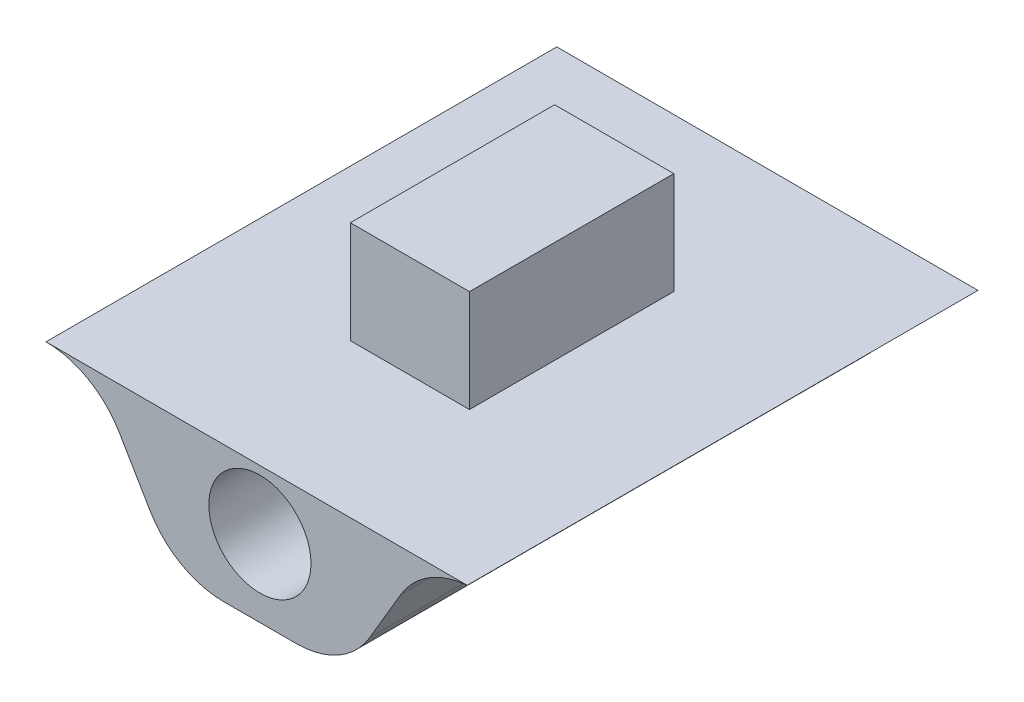
ISO-10303-21;
HEADER;
FILE_DESCRIPTION(('STEP AP214'),'2;1');
FILE_NAME('part.step','',(''),(''),'','','');
FILE_SCHEMA(('AUTOMOTIVE_DESIGN { 1 0 10303 214 1 1 1 1 }'));
ENDSEC;
DATA;
#1=APPLICATION_CONTEXT('core data for automotive mechanical design processes');
#2=APPLICATION_PROTOCOL_DEFINITION('international standard','automotive_design',2000,#1);
#3=PRODUCT_CONTEXT('',#1,'mechanical');
#4=PRODUCT('Part','Part','',(#3));
#5=PRODUCT_RELATED_PRODUCT_CATEGORY('part','',(#4));
#6=PRODUCT_DEFINITION_FORMATION('','',#4);
#7=PRODUCT_DEFINITION_CONTEXT('part definition',#1,'design');
#8=PRODUCT_DEFINITION('design','',#6,#7);
#9=PRODUCT_DEFINITION_SHAPE('','',#8);
#10=(LENGTH_UNIT() NAMED_UNIT(*) SI_UNIT(.MILLI.,.METRE.));
#11=(NAMED_UNIT(*) PLANE_ANGLE_UNIT() SI_UNIT($,.RADIAN.));
#12=(NAMED_UNIT(*) SI_UNIT($,.STERADIAN.) SOLID_ANGLE_UNIT());
#13=UNCERTAINTY_MEASURE_WITH_UNIT(LENGTH_MEASURE(1.E-05),#10,'distance_accuracy_value','');
#14=(GEOMETRIC_REPRESENTATION_CONTEXT(3) GLOBAL_UNCERTAINTY_ASSIGNED_CONTEXT((#13)) GLOBAL_UNIT_ASSIGNED_CONTEXT((#10,
#11,#12)) REPRESENTATION_CONTEXT('',''));
#15=CARTESIAN_POINT('',(0.,0.,0.));
#16=DIRECTION('',(0.,0.,1.));
#17=DIRECTION('',(1.,0.,0.));
#18=AXIS2_PLACEMENT_3D('',#15,#16,#17);
#19=CARTESIAN_POINT('',(-12.5662389811187,0.,30.));
#20=DIRECTION('',(0.000618349914558494,0.999999808821673,0.));
#21=DIRECTION('',(-0.999999808821673,0.000618349914558494,0.));
#22=AXIS2_PLACEMENT_3D('',#19,#20,#21);
#23=PLANE('',#22);
#24=DIRECTION('',(0.999999808821673,-0.000618349914558494,0.));
#25=VECTOR('',#24,1.);
#26=CARTESIAN_POINT('',(-4.80478462315431E-06,-0.00777033131477712,0.));
#27=LINE('',#26,#25);
#28=CARTESIAN_POINT('',(-12.5631472315459,-9.55891633208639E-07,0.));
#29=VERTEX_POINT('',#28);
#30=CARTESIAN_POINT('',(12.1753990297675,-0.0152989926749036,0.));
#31=VERTEX_POINT('',#30);
#32=EDGE_CURVE('E203',#29,#31,#27,.T.);
#33=ORIENTED_EDGE('',*,*,#32,.F.);
#34=DIRECTION('',(0.,0.,1.));
#35=VECTOR('',#34,1.);
#36=CARTESIAN_POINT('',(-12.5631472318414,-1.43383735873998E-06,30.));
#37=LINE('',#36,#35);
#38=CARTESIAN_POINT('',(-12.5631472315459,-9.55891633208639E-07,30.));
#39=VERTEX_POINT('',#38);
#40=EDGE_CURVE('E200',#39,#29,#37,.F.);
#41=ORIENTED_EDGE('',*,*,#40,.F.);
#42=DIRECTION('',(0.999999808821673,-0.000618349914558494,0.));
#43=VECTOR('',#42,1.);
#44=CARTESIAN_POINT('',(-4.80478462315431E-06,-0.00777033131477712,30.));
#45=LINE('',#44,#43);
#46=CARTESIAN_POINT('',(12.1753990297675,-0.0152989926749036,30.));
#47=VERTEX_POINT('',#46);
#48=EDGE_CURVE('E153',#39,#47,#45,.T.);
#49=ORIENTED_EDGE('',*,*,#48,.T.);
#50=DIRECTION('',(0.,0.,1.));
#51=VECTOR('',#50,1.);
#52=CARTESIAN_POINT('',(12.1753990297675,-0.0152989926749036,30.));
#53=LINE('',#52,#51);
#54=EDGE_CURVE('E150',#47,#31,#53,.F.);
#55=ORIENTED_EDGE('',*,*,#54,.T.);
#56=EDGE_LOOP('',(#33,#41,#49,#55));
#57=FACE_BOUND('',#56,.T.);
#58=DIRECTION('',(0.999999808821673,-0.000618349914558494,0.));
#59=VECTOR('',#58,1.);
#60=CARTESIAN_POINT('',(-3.69314892788871,-0.00548667552521801,21.));
#61=LINE('',#60,#59);
#62=CARTESIAN_POINT('',(-3.69314892788871,-0.00548667552521801,21.));
#63=VERTEX_POINT('',#62);
#64=CARTESIAN_POINT('',(3.306849733863,-0.00981512492712747,21.));
#65=VERTEX_POINT('',#64);
#66=EDGE_CURVE('E388',#63,#65,#61,.T.);
#67=ORIENTED_EDGE('',*,*,#66,.F.);
#68=DIRECTION('',(0.,0.,1.));
#69=VECTOR('',#68,1.);
#70=CARTESIAN_POINT('',(-3.69314892788872,-0.00548667552521801,9.));
#71=LINE('',#70,#69);
#72=CARTESIAN_POINT('',(-3.69314892788872,-0.00548667552521801,9.));
#73=VERTEX_POINT('',#72);
#74=EDGE_CURVE('E148',#73,#63,#71,.T.);
#75=ORIENTED_EDGE('',*,*,#74,.F.);
#76=DIRECTION('',(-0.999999808821673,0.000618349914558494,0.));
#77=VECTOR('',#76,1.);
#78=CARTESIAN_POINT('',(-3.69314892788872,-0.00548667552521801,9.));
#79=LINE('',#78,#77);
#80=CARTESIAN_POINT('',(3.306849733863,-0.00981512492712747,9.));
#81=VERTEX_POINT('',#80);
#82=EDGE_CURVE('E144',#81,#73,#79,.T.);
#83=ORIENTED_EDGE('',*,*,#82,.F.);
#84=DIRECTION('',(0.,0.,-1.));
#85=VECTOR('',#84,1.);
#86=CARTESIAN_POINT('',(3.306849733863,-0.00981512492712747,9.));
#87=LINE('',#86,#85);
#88=EDGE_CURVE('E385',#65,#81,#87,.T.);
#89=ORIENTED_EDGE('',*,*,#88,.F.);
#90=EDGE_LOOP('',(#67,#75,#83,#89));
#91=FACE_BOUND('',#90,.T.);
#92=ADVANCED_FACE('F32',(#57,#91),#23,.T.);
#93=CARTESIAN_POINT('',(-2.14054862888333,-3.,30.));
#94=DIRECTION('',(0.,0.,1.));
#95=DIRECTION('',(1.,0.,0.));
#96=AXIS2_PLACEMENT_3D('',#93,#94,#95);
#97=CYLINDRICAL_SURFACE('',#96,5.);
#98=CARTESIAN_POINT('',(-2.14054862888333,-3.,30.));
#99=DIRECTION('',(0.,0.,-1.));
#100=DIRECTION('',(-1.,0.,0.));
#101=AXIS2_PLACEMENT_3D('',#98,#99,#100);
#102=CIRCLE('',#101,5.);
#103=CARTESIAN_POINT('',(-6.45000657940908,-5.5354629109199,30.));
#104=VERTEX_POINT('',#103);
#105=CARTESIAN_POINT('',(-2.14054862888333,-8.,30.));
#106=VERTEX_POINT('',#105);
#107=EDGE_CURVE('E161',#104,#106,#102,.F.);
#108=ORIENTED_EDGE('',*,*,#107,.F.);
#109=DIRECTION('',(0.,0.,-1.));
#110=VECTOR('',#109,1.);
#111=CARTESIAN_POINT('',(-6.45000657940908,-5.5354629109199,30.));
#112=LINE('',#111,#110);
#113=CARTESIAN_POINT('',(-6.45000657940908,-5.5354629109199,0.));
#114=VERTEX_POINT('',#113);
#115=EDGE_CURVE('E164',#114,#104,#112,.F.);
#116=ORIENTED_EDGE('',*,*,#115,.F.);
#117=CARTESIAN_POINT('',(-2.14054862888333,-3.,0.));
#118=DIRECTION('',(0.,0.,-1.));
#119=DIRECTION('',(-1.,0.,0.));
#120=AXIS2_PLACEMENT_3D('',#117,#118,#119);
#121=CIRCLE('',#120,5.);
#122=CARTESIAN_POINT('',(-2.14054862888333,-8.,0.));
#123=VERTEX_POINT('',#122);
#124=EDGE_CURVE('E166',#123,#114,#121,.T.);
#125=ORIENTED_EDGE('',*,*,#124,.F.);
#126=DIRECTION('',(0.,0.,-1.));
#127=VECTOR('',#126,1.);
#128=CARTESIAN_POINT('',(-2.14054862888333,-8.,0.));
#129=LINE('',#128,#127);
#130=EDGE_CURVE('E168',#106,#123,#129,.T.);
#131=ORIENTED_EDGE('',*,*,#130,.F.);
#132=EDGE_LOOP('',(#108,#116,#125,#131));
#133=FACE_BOUND('',#132,.T.);
#134=ADVANCED_FACE('F239',(#133),#97,.T.);
#135=CARTESIAN_POINT('',(0.,-8.,30.));
#136=DIRECTION('',(0.,1.,0.));
#137=DIRECTION('',(0.,0.,1.));
#138=AXIS2_PLACEMENT_3D('',#135,#136,#137);
#139=PLANE('',#138);
#140=DIRECTION('',(1.,0.,0.));
#141=VECTOR('',#140,1.);
#142=CARTESIAN_POINT('',(0.,-8.,30.));
#143=LINE('',#142,#141);
#144=CARTESIAN_POINT('',(2.14054862888333,-8.,30.));
#145=VERTEX_POINT('',#144);
#146=EDGE_CURVE('E187',#106,#145,#143,.T.);
#147=ORIENTED_EDGE('',*,*,#146,.F.);
#148=ORIENTED_EDGE('',*,*,#130,.T.);
#149=DIRECTION('',(1.,0.,0.));
#150=VECTOR('',#149,1.);
#151=CARTESIAN_POINT('',(0.,-8.,0.));
#152=LINE('',#151,#150);
#153=CARTESIAN_POINT('',(2.14054862888333,-8.,0.));
#154=VERTEX_POINT('',#153);
#155=EDGE_CURVE('E186',#123,#154,#152,.T.);
#156=ORIENTED_EDGE('',*,*,#155,.T.);
#157=DIRECTION('',(0.,0.,-1.));
#158=VECTOR('',#157,1.);
#159=CARTESIAN_POINT('',(2.14054862888333,-8.,30.));
#160=LINE('',#159,#158);
#161=EDGE_CURVE('E176',#154,#145,#160,.F.);
#162=ORIENTED_EDGE('',*,*,#161,.T.);
#163=EDGE_LOOP('',(#147,#148,#156,#162));
#164=FACE_BOUND('',#163,.T.);
#165=ADVANCED_FACE('F242',(#164),#139,.F.);
#166=CARTESIAN_POINT('',(2.14054862888333,-3.,30.));
#167=DIRECTION('',(0.,0.,-1.));
#168=DIRECTION('',(-1.,0.,0.));
#169=AXIS2_PLACEMENT_3D('',#166,#167,#168);
#170=CYLINDRICAL_SURFACE('',#169,5.);
#171=CARTESIAN_POINT('',(2.14054862888333,-3.,30.));
#172=DIRECTION('',(0.,0.,-1.));
#173=DIRECTION('',(-1.,0.,0.));
#174=AXIS2_PLACEMENT_3D('',#171,#172,#173);
#175=CIRCLE('',#174,5.);
#176=CARTESIAN_POINT('',(6.45000657940908,-5.5354629109199,30.));
#177=VERTEX_POINT('',#176);
#178=EDGE_CURVE('E174',#145,#177,#175,.F.);
#179=ORIENTED_EDGE('',*,*,#178,.F.);
#180=ORIENTED_EDGE('',*,*,#161,.F.);
#181=CARTESIAN_POINT('',(2.14054862888333,-3.,0.));
#182=DIRECTION('',(0.,0.,-1.));
#183=DIRECTION('',(-1.,0.,0.));
#184=AXIS2_PLACEMENT_3D('',#181,#182,#183);
#185=CIRCLE('',#184,5.);
#186=CARTESIAN_POINT('',(6.45000657940908,-5.5354629109199,0.));
#187=VERTEX_POINT('',#186);
#188=EDGE_CURVE('E57',#187,#154,#185,.T.);
#189=ORIENTED_EDGE('',*,*,#188,.F.);
#190=DIRECTION('',(0.,0.,-1.));
#191=VECTOR('',#190,1.);
#192=CARTESIAN_POINT('',(6.45000657940908,-5.5354629109199,30.));
#193=LINE('',#192,#191);
#194=EDGE_CURVE('E180',#177,#187,#193,.T.);
#195=ORIENTED_EDGE('',*,*,#194,.F.);
#196=EDGE_LOOP('',(#179,#180,#189,#195));
#197=FACE_BOUND('',#196,.T.);
#198=ADVANCED_FACE('F244',(#197),#170,.T.);
#199=CARTESIAN_POINT('',(0.,-3.5,30.));
#200=DIRECTION('',(0.,0.,-1.));
#201=DIRECTION('',(-1.,0.,0.));
#202=AXIS2_PLACEMENT_3D('',#199,#200,#201);
#203=CYLINDRICAL_SURFACE('',#202,3.);
#204=CARTESIAN_POINT('',(0.,-3.5,30.));
#205=DIRECTION('',(0.,0.,1.));
#206=DIRECTION('',(1.,0.,0.));
#207=AXIS2_PLACEMENT_3D('',#204,#205,#206);
#208=CIRCLE('',#207,3.);
#209=CARTESIAN_POINT('',(3.,-3.5,30.));
#210=VERTEX_POINT('',#209);
#211=EDGE_CURVE('E41',#210,#210,#208,.T.);
#212=ORIENTED_EDGE('',*,*,#211,.T.);
#213=EDGE_LOOP('',(#212));
#214=FACE_BOUND('',#213,.T.);
#215=CARTESIAN_POINT('',(0.,-3.5,0.));
#216=DIRECTION('',(0.,0.,1.));
#217=DIRECTION('',(1.,0.,0.));
#218=AXIS2_PLACEMENT_3D('',#215,#216,#217);
#219=CIRCLE('',#218,3.);
#220=CARTESIAN_POINT('',(3.,-3.5,0.));
#221=VERTEX_POINT('',#220);
#222=EDGE_CURVE('E11',#221,#221,#219,.T.);
#223=ORIENTED_EDGE('',*,*,#222,.F.);
#224=EDGE_LOOP('',(#223));
#225=FACE_BOUND('',#224,.T.);
#226=ADVANCED_FACE('F246',(#214,#225),#203,.F.);
#227=CARTESIAN_POINT('',(5.,-8.,30.));
#228=DIRECTION('',(-0.86189159010515,0.507092582183979,0.));
#229=DIRECTION('',(-0.507092582183979,-0.86189159010515,0.));
#230=AXIS2_PLACEMENT_3D('',#227,#228,#229);
#231=PLANE('',#230);
#232=DIRECTION('',(0.507092582183979,0.86189159010515,0.));
#233=VECTOR('',#232,1.);
#234=CARTESIAN_POINT('',(5.,-8.,0.));
#235=LINE('',#234,#233);
#236=CARTESIAN_POINT('',(8.25678103059292,-2.4645370890801,0.));
#237=VERTEX_POINT('',#236);
#238=EDGE_CURVE('E183',#187,#237,#235,.T.);
#239=ORIENTED_EDGE('',*,*,#238,.T.);
#240=DIRECTION('',(0.,0.,-1.));
#241=VECTOR('',#240,1.);
#242=CARTESIAN_POINT('',(8.25678103059292,-2.4645370890801,30.));
#243=LINE('',#242,#241);
#244=CARTESIAN_POINT('',(8.25678103059292,-2.4645370890801,30.));
#245=VERTEX_POINT('',#244);
#246=EDGE_CURVE('E172',#237,#245,#243,.F.);
#247=ORIENTED_EDGE('',*,*,#246,.T.);
#248=DIRECTION('',(0.507092582183979,0.86189159010515,0.));
#249=VECTOR('',#248,1.);
#250=CARTESIAN_POINT('',(5.,-8.,30.));
#251=LINE('',#250,#249);
#252=EDGE_CURVE('E182',#177,#245,#251,.T.);
#253=ORIENTED_EDGE('',*,*,#252,.F.);
#254=ORIENTED_EDGE('',*,*,#194,.T.);
#255=EDGE_LOOP('',(#239,#247,#253,#254));
#256=FACE_BOUND('',#255,.T.);
#257=ADVANCED_FACE('F221',(#256),#231,.F.);
#258=CARTESIAN_POINT('',(-5.,-8.,30.));
#259=DIRECTION('',(-0.86189159010515,-0.507092582183979,0.));
#260=DIRECTION('',(0.507092582183979,-0.86189159010515,0.));
#261=AXIS2_PLACEMENT_3D('',#258,#259,#260);
#262=PLANE('',#261);
#263=DIRECTION('',(-0.507092582183979,0.86189159010515,0.));
#264=VECTOR('',#263,1.);
#265=CARTESIAN_POINT('',(-5.,-8.,30.));
#266=LINE('',#265,#264);
#267=CARTESIAN_POINT('',(-8.25678103059292,-2.4645370890801,30.));
#268=VERTEX_POINT('',#267);
#269=EDGE_CURVE('E189',#104,#268,#266,.T.);
#270=ORIENTED_EDGE('',*,*,#269,.T.);
#271=DIRECTION('',(0.,0.,-1.));
#272=VECTOR('',#271,1.);
#273=CARTESIAN_POINT('',(-8.25678103059292,-2.4645370890801,0.));
#274=LINE('',#273,#272);
#275=CARTESIAN_POINT('',(-8.25678103059292,-2.4645370890801,0.));
#276=VERTEX_POINT('',#275);
#277=EDGE_CURVE('E158',#268,#276,#274,.T.);
#278=ORIENTED_EDGE('',*,*,#277,.T.);
#279=DIRECTION('',(-0.507092582183979,0.86189159010515,0.));
#280=VECTOR('',#279,1.);
#281=CARTESIAN_POINT('',(-5.,-8.,0.));
#282=LINE('',#281,#280);
#283=EDGE_CURVE('E193',#114,#276,#282,.T.);
#284=ORIENTED_EDGE('',*,*,#283,.F.);
#285=ORIENTED_EDGE('',*,*,#115,.T.);
#286=EDGE_LOOP('',(#270,#278,#284,#285));
#287=FACE_BOUND('',#286,.T.);
#288=ADVANCED_FACE('F233',(#287),#262,.T.);
#289=CARTESIAN_POINT('',(0.,0.,0.));
#290=DIRECTION('',(0.,0.,-1.));
#291=DIRECTION('',(-1.,0.,0.));
#292=AXIS2_PLACEMENT_3D('',#289,#290,#291);
#293=PLANE('',#292);
#294=ORIENTED_EDGE('',*,*,#222,.T.);
#295=EDGE_LOOP('',(#294));
#296=FACE_BOUND('',#295,.T.);
#297=CARTESIAN_POINT('',(-12.5662389811187,-5.,0.));
#298=DIRECTION('',(0.,0.,-1.));
#299=DIRECTION('',(-1.,0.,0.));
#300=AXIS2_PLACEMENT_3D('',#297,#298,#299);
#301=CIRCLE('',#300,5.);
#302=EDGE_CURVE('E162',#276,#29,#301,.F.);
#303=ORIENTED_EDGE('',*,*,#302,.T.);
#304=ORIENTED_EDGE('',*,*,#32,.T.);
#305=CARTESIAN_POINT('',(12.5662389811187,-5.,0.));
#306=DIRECTION('',(0.,0.,-1.));
#307=DIRECTION('',(-1.,0.,0.));
#308=AXIS2_PLACEMENT_3D('',#305,#306,#307);
#309=CIRCLE('',#308,5.);
#310=EDGE_CURVE('E36',#31,#237,#309,.F.);
#311=ORIENTED_EDGE('',*,*,#310,.T.);
#312=ORIENTED_EDGE('',*,*,#238,.F.);
#313=ORIENTED_EDGE('',*,*,#188,.T.);
#314=ORIENTED_EDGE('',*,*,#155,.F.);
#315=ORIENTED_EDGE('',*,*,#124,.T.);
#316=ORIENTED_EDGE('',*,*,#283,.T.);
#317=EDGE_LOOP('',(#303,#304,#311,#312,#313,#314,#315,#316));
#318=FACE_BOUND('',#317,.T.);
#319=ADVANCED_FACE('F215',(#296,#318),#293,.T.);
#320=CARTESIAN_POINT('',(0.,0.,30.));
#321=DIRECTION('',(0.,0.,-1.));
#322=DIRECTION('',(-1.,0.,0.));
#323=AXIS2_PLACEMENT_3D('',#320,#321,#322);
#324=PLANE('',#323);
#325=ORIENTED_EDGE('',*,*,#211,.F.);
#326=EDGE_LOOP('',(#325));
#327=FACE_BOUND('',#326,.T.);
#328=ORIENTED_EDGE('',*,*,#48,.F.);
#329=CARTESIAN_POINT('',(-12.5662389811187,-5.,30.));
#330=DIRECTION('',(0.,0.,-1.));
#331=DIRECTION('',(-1.,0.,0.));
#332=AXIS2_PLACEMENT_3D('',#329,#330,#331);
#333=CIRCLE('',#332,5.);
#334=EDGE_CURVE('E202',#39,#268,#333,.T.);
#335=ORIENTED_EDGE('',*,*,#334,.T.);
#336=ORIENTED_EDGE('',*,*,#269,.F.);
#337=ORIENTED_EDGE('',*,*,#107,.T.);
#338=ORIENTED_EDGE('',*,*,#146,.T.);
#339=ORIENTED_EDGE('',*,*,#178,.T.);
#340=ORIENTED_EDGE('',*,*,#252,.T.);
#341=CARTESIAN_POINT('',(12.5662389811187,-5.,30.));
#342=DIRECTION('',(0.,0.,-1.));
#343=DIRECTION('',(-1.,0.,0.));
#344=AXIS2_PLACEMENT_3D('',#341,#342,#343);
#345=CIRCLE('',#344,5.);
#346=EDGE_CURVE('E171',#245,#47,#345,.T.);
#347=ORIENTED_EDGE('',*,*,#346,.T.);
#348=EDGE_LOOP('',(#328,#335,#336,#337,#338,#339,#340,#347));
#349=FACE_BOUND('',#348,.T.);
#350=ADVANCED_FACE('F226',(#327,#349),#324,.F.);
#351=CARTESIAN_POINT('',(-12.5662389811187,-5.,30.));
#352=DIRECTION('',(0.,0.,1.));
#353=DIRECTION('',(1.,0.,0.));
#354=AXIS2_PLACEMENT_3D('',#351,#352,#353);
#355=CYLINDRICAL_SURFACE('',#354,5.);
#356=ORIENTED_EDGE('',*,*,#334,.F.);
#357=ORIENTED_EDGE('',*,*,#40,.T.);
#358=ORIENTED_EDGE('',*,*,#302,.F.);
#359=ORIENTED_EDGE('',*,*,#277,.F.);
#360=EDGE_LOOP('',(#356,#357,#358,#359));
#361=FACE_BOUND('',#360,.T.);
#362=ADVANCED_FACE('F230',(#361),#355,.F.);
#363=CARTESIAN_POINT('',(12.5662389811187,-5.,30.));
#364=DIRECTION('',(0.,0.,1.));
#365=DIRECTION('',(1.,0.,0.));
#366=AXIS2_PLACEMENT_3D('',#363,#364,#365);
#367=CYLINDRICAL_SURFACE('',#366,5.);
#368=ORIENTED_EDGE('',*,*,#54,.F.);
#369=ORIENTED_EDGE('',*,*,#346,.F.);
#370=ORIENTED_EDGE('',*,*,#246,.F.);
#371=ORIENTED_EDGE('',*,*,#310,.F.);
#372=EDGE_LOOP('',(#368,#369,#370,#371));
#373=FACE_BOUND('',#372,.T.);
#374=ADVANCED_FACE('F34',(#373),#367,.F.);
#375=CARTESIAN_POINT('',(-3.68943882840136,5.99451217740482,9.));
#376=DIRECTION('',(0.999999808821673,-0.000618349914558494,0.));
#377=DIRECTION('',(0.000618349914558494,0.999999808821673,0.));
#378=AXIS2_PLACEMENT_3D('',#375,#376,#377);
#379=PLANE('',#378);
#380=ORIENTED_EDGE('',*,*,#74,.T.);
#381=DIRECTION('',(-0.000618349914558494,-0.999999808821673,0.));
#382=VECTOR('',#381,1.);
#383=CARTESIAN_POINT('',(-3.68943882840136,5.99451217740482,21.));
#384=LINE('',#383,#382);
#385=CARTESIAN_POINT('',(-3.68943882840136,5.99451217740482,21.));
#386=VERTEX_POINT('',#385);
#387=EDGE_CURVE('E129',#386,#63,#384,.T.);
#388=ORIENTED_EDGE('',*,*,#387,.F.);
#389=DIRECTION('',(0.,0.,1.));
#390=VECTOR('',#389,1.);
#391=CARTESIAN_POINT('',(-3.68943882840136,5.99451217740482,9.));
#392=LINE('',#391,#390);
#393=CARTESIAN_POINT('',(-3.68943882840136,5.99451217740482,9.));
#394=VERTEX_POINT('',#393);
#395=EDGE_CURVE('E136',#394,#386,#392,.T.);
#396=ORIENTED_EDGE('',*,*,#395,.F.);
#397=DIRECTION('',(-0.000618349914558494,-0.999999808821673,0.));
#398=VECTOR('',#397,1.);
#399=CARTESIAN_POINT('',(-3.68943882840136,5.99451217740482,9.));
#400=LINE('',#399,#398);
#401=EDGE_CURVE('E383',#394,#73,#400,.T.);
#402=ORIENTED_EDGE('',*,*,#401,.T.);
#403=EDGE_LOOP('',(#380,#388,#396,#402));
#404=FACE_BOUND('',#403,.T.);
#405=ADVANCED_FACE('F146',(#404),#379,.F.);
#406=CARTESIAN_POINT('',(-3.68943882840136,5.99451217740482,21.));
#407=DIRECTION('',(0.,0.,-1.));
#408=DIRECTION('',(-1.,0.,0.));
#409=AXIS2_PLACEMENT_3D('',#406,#407,#408);
#410=PLANE('',#409);
#411=ORIENTED_EDGE('',*,*,#66,.T.);
#412=DIRECTION('',(-0.000618349914558494,-0.999999808821673,0.));
#413=VECTOR('',#412,1.);
#414=CARTESIAN_POINT('',(3.31055983335035,5.99018372800291,21.));
#415=LINE('',#414,#413);
#416=CARTESIAN_POINT('',(3.31055983335035,5.99018372800291,21.));
#417=VERTEX_POINT('',#416);
#418=EDGE_CURVE('E132',#417,#65,#415,.T.);
#419=ORIENTED_EDGE('',*,*,#418,.F.);
#420=DIRECTION('',(0.999999808821673,-0.000618349914558494,0.));
#421=VECTOR('',#420,1.);
#422=CARTESIAN_POINT('',(-3.68943882840136,5.99451217740482,21.));
#423=LINE('',#422,#421);
#424=EDGE_CURVE('E125',#386,#417,#423,.T.);
#425=ORIENTED_EDGE('',*,*,#424,.F.);
#426=ORIENTED_EDGE('',*,*,#387,.T.);
#427=EDGE_LOOP('',(#411,#419,#425,#426));
#428=FACE_BOUND('',#427,.T.);
#429=ADVANCED_FACE('F127',(#428),#410,.F.);
#430=CARTESIAN_POINT('',(3.31055983335035,5.99018372800291,9.));
#431=DIRECTION('',(-0.999999808821673,0.000618349914558494,0.));
#432=DIRECTION('',(-0.000618349914558494,-0.999999808821673,0.));
#433=AXIS2_PLACEMENT_3D('',#430,#431,#432);
#434=PLANE('',#433);
#435=ORIENTED_EDGE('',*,*,#88,.T.);
#436=DIRECTION('',(-0.000618349914558494,-0.999999808821673,0.));
#437=VECTOR('',#436,1.);
#438=CARTESIAN_POINT('',(3.31055983335035,5.99018372800291,9.));
#439=LINE('',#438,#437);
#440=CARTESIAN_POINT('',(3.31055983335035,5.99018372800291,9.));
#441=VERTEX_POINT('',#440);
#442=EDGE_CURVE('E49',#441,#81,#439,.T.);
#443=ORIENTED_EDGE('',*,*,#442,.F.);
#444=DIRECTION('',(0.,0.,-1.));
#445=VECTOR('',#444,1.);
#446=CARTESIAN_POINT('',(3.31055983335035,5.99018372800291,9.));
#447=LINE('',#446,#445);
#448=EDGE_CURVE('E135',#417,#441,#447,.T.);
#449=ORIENTED_EDGE('',*,*,#448,.F.);
#450=ORIENTED_EDGE('',*,*,#418,.T.);
#451=EDGE_LOOP('',(#435,#443,#449,#450));
#452=FACE_BOUND('',#451,.T.);
#453=ADVANCED_FACE('F349',(#452),#434,.F.);
#454=CARTESIAN_POINT('',(-3.68943882840136,5.99451217740482,9.));
#455=DIRECTION('',(0.,0.,1.));
#456=DIRECTION('',(1.,0.,0.));
#457=AXIS2_PLACEMENT_3D('',#454,#455,#456);
#458=PLANE('',#457);
#459=ORIENTED_EDGE('',*,*,#82,.T.);
#460=ORIENTED_EDGE('',*,*,#401,.F.);
#461=DIRECTION('',(-0.999999808821673,0.000618349914558494,0.));
#462=VECTOR('',#461,1.);
#463=CARTESIAN_POINT('',(-3.68943882840136,5.99451217740482,9.));
#464=LINE('',#463,#462);
#465=EDGE_CURVE('E140',#441,#394,#464,.T.);
#466=ORIENTED_EDGE('',*,*,#465,.F.);
#467=ORIENTED_EDGE('',*,*,#442,.T.);
#468=EDGE_LOOP('',(#459,#460,#466,#467));
#469=FACE_BOUND('',#468,.T.);
#470=ADVANCED_FACE('F356',(#469),#458,.F.);
#471=CARTESIAN_POINT('',(0.00370529470272781,5.99222852161526,0.));
#472=DIRECTION('',(0.000618349914558494,0.999999808821673,0.));
#473=DIRECTION('',(-0.999999808821673,0.000618349914558494,0.));
#474=AXIS2_PLACEMENT_3D('',#471,#472,#473);
#475=PLANE('',#474);
#476=ORIENTED_EDGE('',*,*,#395,.T.);
#477=ORIENTED_EDGE('',*,*,#424,.T.);
#478=ORIENTED_EDGE('',*,*,#448,.T.);
#479=ORIENTED_EDGE('',*,*,#465,.T.);
#480=EDGE_LOOP('',(#476,#477,#478,#479));
#481=FACE_BOUND('',#480,.T.);
#482=ADVANCED_FACE('F139',(#481),#475,.T.);
#483=CLOSED_SHELL('',(#92,#134,#165,#198,#226,#257,#288,#319,#350,#362,#374,#405,#429,#453,#470,#482));
#484=MANIFOLD_SOLID_BREP('B2',#483);
#485=ADVANCED_BREP_SHAPE_REPRESENTATION('',(#18,#484),#14);
#486=SHAPE_DEFINITION_REPRESENTATION(#9,#485);
ENDSEC;
END-ISO-10303-21;
